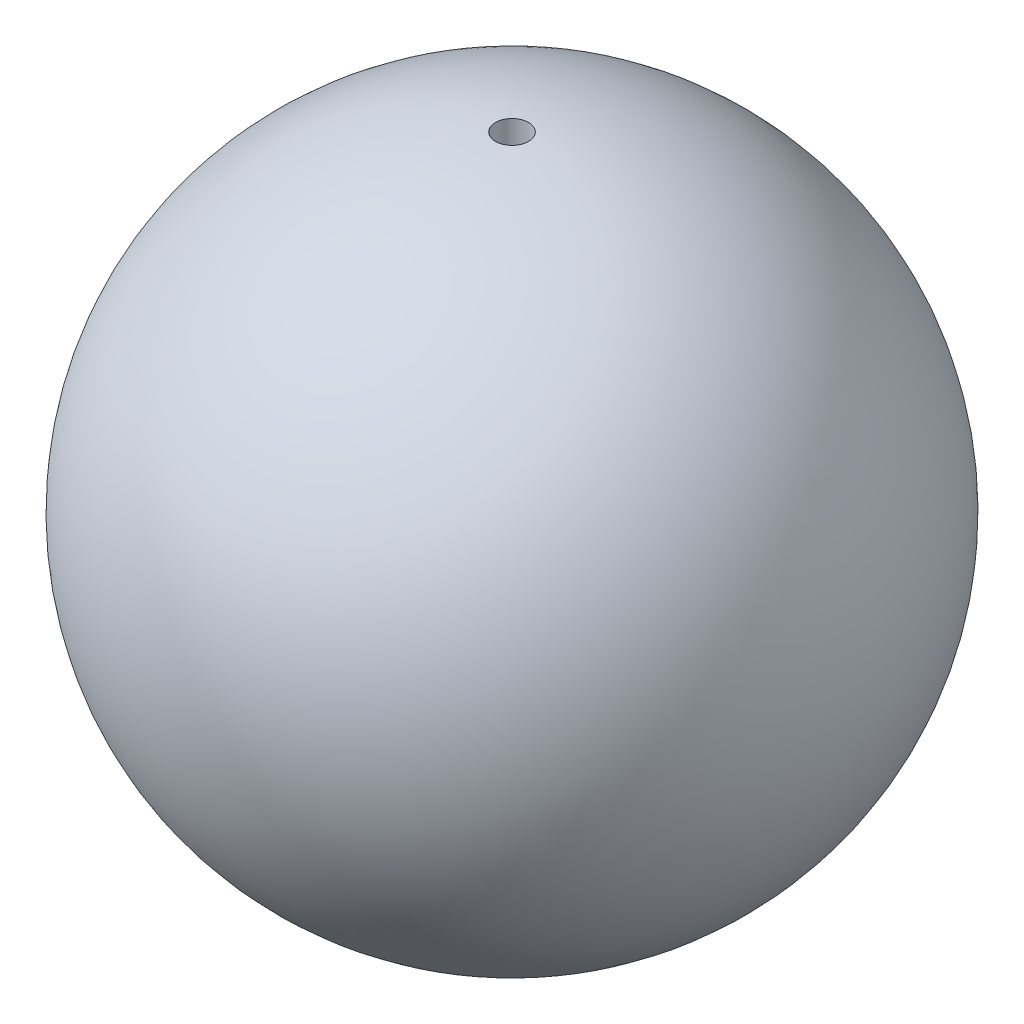
ISO-10303-21;
HEADER;
FILE_DESCRIPTION(('STEP AP214'),'2;1');
FILE_NAME('part.step','',(''),(''),'','','');
FILE_SCHEMA(('AUTOMOTIVE_DESIGN { 1 0 10303 214 1 1 1 1 }'));
ENDSEC;
DATA;
#1=APPLICATION_CONTEXT('core data for automotive mechanical design processes');
#2=APPLICATION_PROTOCOL_DEFINITION('international standard','automotive_design',2000,#1);
#3=PRODUCT_CONTEXT('',#1,'mechanical');
#4=PRODUCT('Part','Part','',(#3));
#5=PRODUCT_RELATED_PRODUCT_CATEGORY('part','',(#4));
#6=PRODUCT_DEFINITION_FORMATION('','',#4);
#7=PRODUCT_DEFINITION_CONTEXT('part definition',#1,'design');
#8=PRODUCT_DEFINITION('design','',#6,#7);
#9=PRODUCT_DEFINITION_SHAPE('','',#8);
#10=(LENGTH_UNIT() NAMED_UNIT(*) SI_UNIT(.MILLI.,.METRE.));
#11=(NAMED_UNIT(*) PLANE_ANGLE_UNIT() SI_UNIT($,.RADIAN.));
#12=(NAMED_UNIT(*) SI_UNIT($,.STERADIAN.) SOLID_ANGLE_UNIT());
#13=UNCERTAINTY_MEASURE_WITH_UNIT(LENGTH_MEASURE(1.E-05),#10,'distance_accuracy_value','');
#14=(GEOMETRIC_REPRESENTATION_CONTEXT(3) GLOBAL_UNCERTAINTY_ASSIGNED_CONTEXT((#13)) GLOBAL_UNIT_ASSIGNED_CONTEXT((#10,
#11,#12)) REPRESENTATION_CONTEXT('',''));
#15=CARTESIAN_POINT('',(0.,0.,0.));
#16=DIRECTION('',(0.,0.,1.));
#17=DIRECTION('',(1.,0.,0.));
#18=AXIS2_PLACEMENT_3D('',#15,#16,#17);
#19=CARTESIAN_POINT('',(0.,0.,0.));
#20=DIRECTION('',(-1.,0.,0.));
#21=DIRECTION('',(0.,0.,-1.));
#22=AXIS2_PLACEMENT_3D('',#19,#20,#21);
#23=SPHERICAL_SURFACE('',#22,12.5);
#24=CARTESIAN_POINT('',(0.,0.,0.));
#25=DIRECTION('',(0.,-1.,0.));
#26=DIRECTION('',(0.,0.,-1.));
#27=AXIS2_PLACEMENT_3D('',#24,#25,#26);
#28=SPHERICAL_SURFACE('',#27,12.5);
#29=CARTESIAN_POINT('',(0.,12.4843652221489,0.));
#30=DIRECTION('',(0.,-1.,0.));
#31=DIRECTION('',(0.,0.,-1.));
#32=AXIS2_PLACEMENT_3D('',#29,#30,#31);
#33=CIRCLE('',#32,0.625);
#34=CARTESIAN_POINT('',(0.,12.4843652221489,-0.625));
#35=VERTEX_POINT('',#34);
#36=EDGE_CURVE('E10',#35,#35,#33,.F.);
#37=ORIENTED_EDGE('',*,*,#36,.F.);
#38=EDGE_LOOP('',(#37));
#39=FACE_BOUND('',#38,.T.);
#40=CARTESIAN_POINT('',(0.,-12.4843652221489,0.));
#41=DIRECTION('',(0.,1.,0.));
#42=DIRECTION('',(0.,0.,1.));
#43=AXIS2_PLACEMENT_3D('',#40,#41,#42);
#44=CIRCLE('',#43,0.625);
#45=CARTESIAN_POINT('',(0.,-12.4843652221489,0.625));
#46=VERTEX_POINT('',#45);
#47=EDGE_CURVE('E36',#46,#46,#44,.F.);
#48=ORIENTED_EDGE('',*,*,#47,.F.);
#49=EDGE_LOOP('',(#48));
#50=FACE_BOUND('',#49,.T.);
#51=ADVANCED_FACE('F30',(#39,#50),#28,.T.);
#52=CARTESIAN_POINT('',(0.,-12.5,0.));
#53=DIRECTION('',(0.,1.,0.));
#54=DIRECTION('',(0.,0.,1.));
#55=AXIS2_PLACEMENT_3D('',#52,#53,#54);
#56=CYLINDRICAL_SURFACE('',#55,0.625);
#57=ORIENTED_EDGE('',*,*,#36,.T.);
#58=EDGE_LOOP('',(#57));
#59=FACE_BOUND('',#58,.T.);
#60=ORIENTED_EDGE('',*,*,#47,.T.);
#61=EDGE_LOOP('',(#60));
#62=FACE_BOUND('',#61,.T.);
#63=ADVANCED_FACE('F42',(#59,#62),#56,.F.);
#64=CLOSED_SHELL('',(#51,#63));
#65=MANIFOLD_SOLID_BREP('B2',#64);
#66=ADVANCED_BREP_SHAPE_REPRESENTATION('',(#18,#65),#14);
#67=SHAPE_DEFINITION_REPRESENTATION(#9,#66);
ENDSEC;
END-ISO-10303-21;
